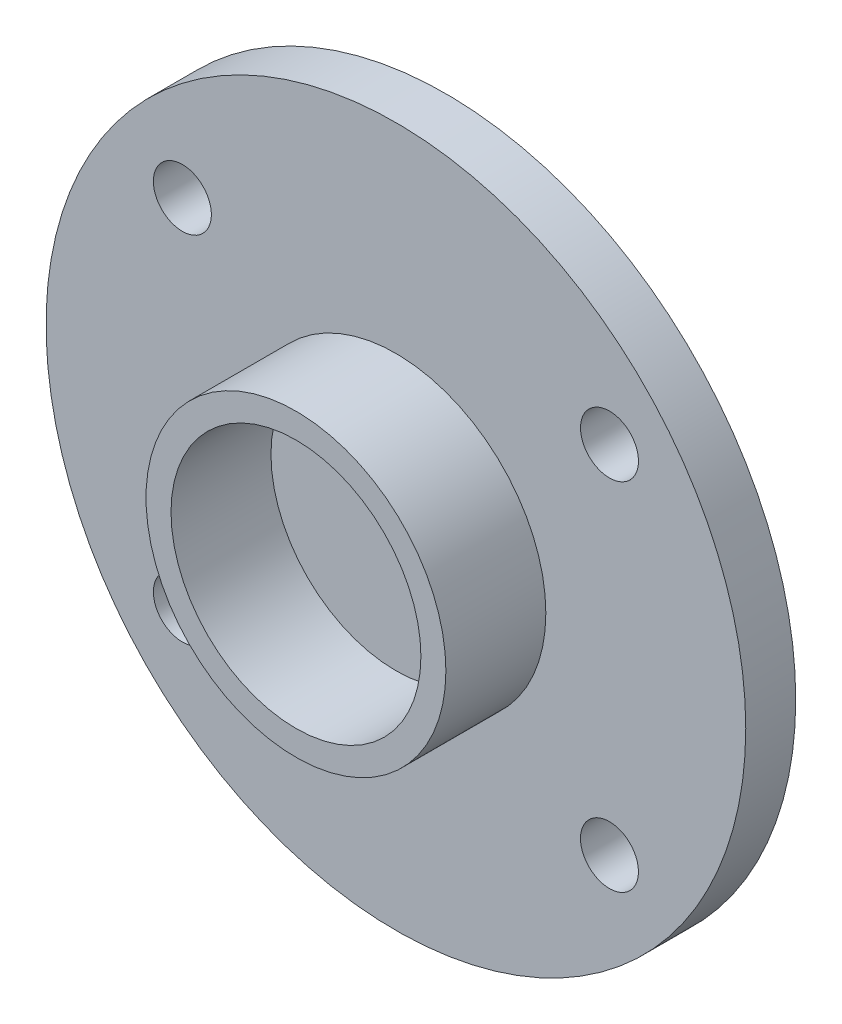
ISO-10303-21;
HEADER;
FILE_DESCRIPTION(('STEP AP214'),'2;1');
FILE_NAME('part.step','',(''),(''),'','','');
FILE_SCHEMA(('AUTOMOTIVE_DESIGN { 1 0 10303 214 1 1 1 1 }'));
ENDSEC;
DATA;
#1=APPLICATION_CONTEXT('core data for automotive mechanical design processes');
#2=APPLICATION_PROTOCOL_DEFINITION('international standard','automotive_design',2000,#1);
#3=PRODUCT_CONTEXT('',#1,'mechanical');
#4=PRODUCT('Part','Part','',(#3));
#5=PRODUCT_RELATED_PRODUCT_CATEGORY('part','',(#4));
#6=PRODUCT_DEFINITION_FORMATION('','',#4);
#7=PRODUCT_DEFINITION_CONTEXT('part definition',#1,'design');
#8=PRODUCT_DEFINITION('design','',#6,#7);
#9=PRODUCT_DEFINITION_SHAPE('','',#8);
#10=(LENGTH_UNIT() NAMED_UNIT(*) SI_UNIT(.MILLI.,.METRE.));
#11=(NAMED_UNIT(*) PLANE_ANGLE_UNIT() SI_UNIT($,.RADIAN.));
#12=(NAMED_UNIT(*) SI_UNIT($,.STERADIAN.) SOLID_ANGLE_UNIT());
#13=UNCERTAINTY_MEASURE_WITH_UNIT(LENGTH_MEASURE(1.E-05),#10,'distance_accuracy_value','');
#14=(GEOMETRIC_REPRESENTATION_CONTEXT(3) GLOBAL_UNCERTAINTY_ASSIGNED_CONTEXT((#13)) GLOBAL_UNIT_ASSIGNED_CONTEXT((#10,
#11,#12)) REPRESENTATION_CONTEXT('',''));
#15=CARTESIAN_POINT('',(0.,0.,0.));
#16=DIRECTION('',(0.,0.,1.));
#17=DIRECTION('',(1.,0.,0.));
#18=AXIS2_PLACEMENT_3D('',#15,#16,#17);
#19=CARTESIAN_POINT('',(0.,0.,1.));
#20=DIRECTION('',(0.,0.,1.));
#21=DIRECTION('',(1.,0.,0.));
#22=AXIS2_PLACEMENT_3D('',#19,#20,#21);
#23=PLANE('',#22);
#24=CARTESIAN_POINT('',(0.,0.,1.));
#25=DIRECTION('',(0.,0.,1.));
#26=DIRECTION('',(1.,0.,0.));
#27=AXIS2_PLACEMENT_3D('',#24,#25,#26);
#28=CIRCLE('',#27,3.);
#29=CARTESIAN_POINT('',(3.,0.,1.));
#30=VERTEX_POINT('',#29);
#31=EDGE_CURVE('E82',#30,#30,#28,.T.);
#32=ORIENTED_EDGE('',*,*,#31,.F.);
#33=EDGE_LOOP('',(#32));
#34=FACE_BOUND('',#33,.T.);
#35=CARTESIAN_POINT('',(4.27289845973805,-3.55751862296857,1.));
#36=DIRECTION('',(0.,0.,1.));
#37=DIRECTION('',(-1.,0.,0.));
#38=AXIS2_PLACEMENT_3D('',#35,#36,#37);
#39=CIRCLE('',#38,0.580000000000001);
#40=CARTESIAN_POINT('',(3.69289845973805,-3.55751862296857,1.));
#41=VERTEX_POINT('',#40);
#42=EDGE_CURVE('E67',#41,#41,#39,.T.);
#43=ORIENTED_EDGE('',*,*,#42,.F.);
#44=EDGE_LOOP('',(#43));
#45=FACE_BOUND('',#44,.T.);
#46=CARTESIAN_POINT('',(4.27289845973805,3.55751862296857,1.));
#47=DIRECTION('',(0.,0.,1.));
#48=DIRECTION('',(1.,0.,0.));
#49=AXIS2_PLACEMENT_3D('',#46,#47,#48);
#50=CIRCLE('',#49,0.580000000000001);
#51=CARTESIAN_POINT('',(4.85289845973805,3.55751862296857,1.));
#52=VERTEX_POINT('',#51);
#53=EDGE_CURVE('E56',#52,#52,#50,.T.);
#54=ORIENTED_EDGE('',*,*,#53,.F.);
#55=EDGE_LOOP('',(#54));
#56=FACE_BOUND('',#55,.T.);
#57=CARTESIAN_POINT('',(0.,0.,1.));
#58=DIRECTION('',(0.,0.,1.));
#59=DIRECTION('',(1.,0.,0.));
#60=AXIS2_PLACEMENT_3D('',#57,#58,#59);
#61=CIRCLE('',#60,7.);
#62=CARTESIAN_POINT('',(7.,0.,1.));
#63=VERTEX_POINT('',#62);
#64=EDGE_CURVE('E47',#63,#63,#61,.T.);
#65=ORIENTED_EDGE('',*,*,#64,.T.);
#66=EDGE_LOOP('',(#65));
#67=FACE_BOUND('',#66,.T.);
#68=CARTESIAN_POINT('',(-4.27289845973805,3.55751862296857,1.));
#69=DIRECTION('',(0.,0.,1.));
#70=DIRECTION('',(-1.,0.,0.));
#71=AXIS2_PLACEMENT_3D('',#68,#69,#70);
#72=CIRCLE('',#71,0.58);
#73=CARTESIAN_POINT('',(-4.85289845973805,3.55751862296857,1.));
#74=VERTEX_POINT('',#73);
#75=EDGE_CURVE('E61',#74,#74,#72,.T.);
#76=ORIENTED_EDGE('',*,*,#75,.F.);
#77=EDGE_LOOP('',(#76));
#78=FACE_BOUND('',#77,.T.);
#79=CARTESIAN_POINT('',(-4.27289845973805,-3.55751862296857,1.));
#80=DIRECTION('',(0.,0.,1.));
#81=DIRECTION('',(1.,0.,0.));
#82=AXIS2_PLACEMENT_3D('',#79,#80,#81);
#83=CIRCLE('',#82,0.58);
#84=CARTESIAN_POINT('',(-3.69289845973805,-3.55751862296857,1.));
#85=VERTEX_POINT('',#84);
#86=EDGE_CURVE('E73',#85,#85,#83,.T.);
#87=ORIENTED_EDGE('',*,*,#86,.F.);
#88=EDGE_LOOP('',(#87));
#89=FACE_BOUND('',#88,.T.);
#90=ADVANCED_FACE('F40',(#34,#45,#56,#67,#78,#89),#23,.T.);
#91=CARTESIAN_POINT('',(0.,0.,0.));
#92=DIRECTION('',(0.,0.,1.));
#93=DIRECTION('',(1.,0.,0.));
#94=AXIS2_PLACEMENT_3D('',#91,#92,#93);
#95=PLANE('',#94);
#96=CARTESIAN_POINT('',(0.,0.,0.));
#97=DIRECTION('',(0.,0.,1.));
#98=DIRECTION('',(1.,0.,0.));
#99=AXIS2_PLACEMENT_3D('',#96,#97,#98);
#100=CIRCLE('',#99,7.);
#101=CARTESIAN_POINT('',(7.,0.,0.));
#102=VERTEX_POINT('',#101);
#103=EDGE_CURVE('E51',#102,#102,#100,.T.);
#104=ORIENTED_EDGE('',*,*,#103,.F.);
#105=EDGE_LOOP('',(#104));
#106=FACE_BOUND('',#105,.T.);
#107=CARTESIAN_POINT('',(4.27289845973805,3.55751862296857,0.));
#108=DIRECTION('',(0.,0.,1.));
#109=DIRECTION('',(1.,0.,0.));
#110=AXIS2_PLACEMENT_3D('',#107,#108,#109);
#111=CIRCLE('',#110,0.580000000000001);
#112=CARTESIAN_POINT('',(4.85289845973805,3.55751862296857,0.));
#113=VERTEX_POINT('',#112);
#114=EDGE_CURVE('E58',#113,#113,#111,.T.);
#115=ORIENTED_EDGE('',*,*,#114,.T.);
#116=EDGE_LOOP('',(#115));
#117=FACE_BOUND('',#116,.T.);
#118=CARTESIAN_POINT('',(-4.27289845973805,3.55751862296857,0.));
#119=DIRECTION('',(0.,0.,1.));
#120=DIRECTION('',(-1.,0.,0.));
#121=AXIS2_PLACEMENT_3D('',#118,#119,#120);
#122=CIRCLE('',#121,0.58);
#123=CARTESIAN_POINT('',(-4.85289845973805,3.55751862296857,0.));
#124=VERTEX_POINT('',#123);
#125=EDGE_CURVE('E64',#124,#124,#122,.T.);
#126=ORIENTED_EDGE('',*,*,#125,.T.);
#127=EDGE_LOOP('',(#126));
#128=FACE_BOUND('',#127,.T.);
#129=CARTESIAN_POINT('',(4.27289845973805,-3.55751862296857,0.));
#130=DIRECTION('',(0.,0.,1.));
#131=DIRECTION('',(-1.,0.,0.));
#132=AXIS2_PLACEMENT_3D('',#129,#130,#131);
#133=CIRCLE('',#132,0.580000000000001);
#134=CARTESIAN_POINT('',(3.69289845973805,-3.55751862296857,0.));
#135=VERTEX_POINT('',#134);
#136=EDGE_CURVE('E70',#135,#135,#133,.T.);
#137=ORIENTED_EDGE('',*,*,#136,.T.);
#138=EDGE_LOOP('',(#137));
#139=FACE_BOUND('',#138,.T.);
#140=CARTESIAN_POINT('',(-4.27289845973805,-3.55751862296857,0.));
#141=DIRECTION('',(0.,0.,1.));
#142=DIRECTION('',(1.,0.,0.));
#143=AXIS2_PLACEMENT_3D('',#140,#141,#142);
#144=CIRCLE('',#143,0.58);
#145=CARTESIAN_POINT('',(-3.69289845973805,-3.55751862296857,0.));
#146=VERTEX_POINT('',#145);
#147=EDGE_CURVE('E76',#146,#146,#144,.T.);
#148=ORIENTED_EDGE('',*,*,#147,.T.);
#149=EDGE_LOOP('',(#148));
#150=FACE_BOUND('',#149,.T.);
#151=ADVANCED_FACE('F110',(#106,#117,#128,#139,#150),#95,.F.);
#152=CARTESIAN_POINT('',(0.,0.,1.));
#153=DIRECTION('',(0.,0.,-1.));
#154=DIRECTION('',(-1.,0.,0.));
#155=AXIS2_PLACEMENT_3D('',#152,#153,#154);
#156=CYLINDRICAL_SURFACE('',#155,7.);
#157=ORIENTED_EDGE('',*,*,#64,.F.);
#158=EDGE_LOOP('',(#157));
#159=FACE_BOUND('',#158,.T.);
#160=ORIENTED_EDGE('',*,*,#103,.T.);
#161=EDGE_LOOP('',(#160));
#162=FACE_BOUND('',#161,.T.);
#163=ADVANCED_FACE('F42',(#159,#162),#156,.T.);
#164=CARTESIAN_POINT('',(4.27289845973805,3.55751862296857,1.));
#165=DIRECTION('',(0.,0.,-1.));
#166=DIRECTION('',(-1.,0.,0.));
#167=AXIS2_PLACEMENT_3D('',#164,#165,#166);
#168=CYLINDRICAL_SURFACE('',#167,0.580000000000001);
#169=ORIENTED_EDGE('',*,*,#53,.T.);
#170=EDGE_LOOP('',(#169));
#171=FACE_BOUND('',#170,.T.);
#172=ORIENTED_EDGE('',*,*,#114,.F.);
#173=EDGE_LOOP('',(#172));
#174=FACE_BOUND('',#173,.T.);
#175=ADVANCED_FACE('F167',(#171,#174),#168,.F.);
#176=CARTESIAN_POINT('',(-4.27289845973805,3.55751862296857,1.));
#177=DIRECTION('',(0.,0.,-1.));
#178=DIRECTION('',(-1.,0.,0.));
#179=AXIS2_PLACEMENT_3D('',#176,#177,#178);
#180=CYLINDRICAL_SURFACE('',#179,0.58);
#181=ORIENTED_EDGE('',*,*,#75,.T.);
#182=EDGE_LOOP('',(#181));
#183=FACE_BOUND('',#182,.T.);
#184=ORIENTED_EDGE('',*,*,#125,.F.);
#185=EDGE_LOOP('',(#184));
#186=FACE_BOUND('',#185,.T.);
#187=ADVANCED_FACE('F157',(#183,#186),#180,.F.);
#188=CARTESIAN_POINT('',(4.27289845973805,-3.55751862296857,1.));
#189=DIRECTION('',(0.,0.,-1.));
#190=DIRECTION('',(-1.,0.,0.));
#191=AXIS2_PLACEMENT_3D('',#188,#189,#190);
#192=CYLINDRICAL_SURFACE('',#191,0.580000000000001);
#193=ORIENTED_EDGE('',*,*,#42,.T.);
#194=EDGE_LOOP('',(#193));
#195=FACE_BOUND('',#194,.T.);
#196=ORIENTED_EDGE('',*,*,#136,.F.);
#197=EDGE_LOOP('',(#196));
#198=FACE_BOUND('',#197,.T.);
#199=ADVANCED_FACE('F105',(#195,#198),#192,.F.);
#200=CARTESIAN_POINT('',(-4.27289845973805,-3.55751862296857,1.));
#201=DIRECTION('',(0.,0.,-1.));
#202=DIRECTION('',(-1.,0.,0.));
#203=AXIS2_PLACEMENT_3D('',#200,#201,#202);
#204=CYLINDRICAL_SURFACE('',#203,0.58);
#205=ORIENTED_EDGE('',*,*,#86,.T.);
#206=EDGE_LOOP('',(#205));
#207=FACE_BOUND('',#206,.T.);
#208=ORIENTED_EDGE('',*,*,#147,.F.);
#209=EDGE_LOOP('',(#208));
#210=FACE_BOUND('',#209,.T.);
#211=ADVANCED_FACE('F96',(#207,#210),#204,.F.);
#212=CARTESIAN_POINT('',(0.,0.,3.));
#213=DIRECTION('',(0.,0.,1.));
#214=DIRECTION('',(1.,0.,0.));
#215=AXIS2_PLACEMENT_3D('',#212,#213,#214);
#216=PLANE('',#215);
#217=CARTESIAN_POINT('',(0.,0.,3.));
#218=DIRECTION('',(0.,0.,1.));
#219=DIRECTION('',(1.,0.,0.));
#220=AXIS2_PLACEMENT_3D('',#217,#218,#219);
#221=CIRCLE('',#220,3.);
#222=CARTESIAN_POINT('',(3.,0.,3.));
#223=VERTEX_POINT('',#222);
#224=EDGE_CURVE('E79',#223,#223,#221,.T.);
#225=ORIENTED_EDGE('',*,*,#224,.T.);
#226=EDGE_LOOP('',(#225));
#227=FACE_BOUND('',#226,.T.);
#228=CARTESIAN_POINT('',(0.,0.,3.));
#229=DIRECTION('',(0.,0.,1.));
#230=DIRECTION('',(1.,0.,0.));
#231=AXIS2_PLACEMENT_3D('',#228,#229,#230);
#232=CIRCLE('',#231,2.5);
#233=CARTESIAN_POINT('',(2.5,0.,3.));
#234=VERTEX_POINT('',#233);
#235=EDGE_CURVE('E85',#234,#234,#232,.T.);
#236=ORIENTED_EDGE('',*,*,#235,.F.);
#237=EDGE_LOOP('',(#236));
#238=FACE_BOUND('',#237,.T.);
#239=ADVANCED_FACE('F93',(#227,#238),#216,.T.);
#240=CARTESIAN_POINT('',(0.,0.,3.));
#241=DIRECTION('',(0.,0.,-1.));
#242=DIRECTION('',(-1.,0.,0.));
#243=AXIS2_PLACEMENT_3D('',#240,#241,#242);
#244=CYLINDRICAL_SURFACE('',#243,3.);
#245=ORIENTED_EDGE('',*,*,#224,.F.);
#246=EDGE_LOOP('',(#245));
#247=FACE_BOUND('',#246,.T.);
#248=ORIENTED_EDGE('',*,*,#31,.T.);
#249=EDGE_LOOP('',(#248));
#250=FACE_BOUND('',#249,.T.);
#251=ADVANCED_FACE('F95',(#247,#250),#244,.T.);
#252=CARTESIAN_POINT('',(0.,0.,3.));
#253=DIRECTION('',(0.,0.,-1.));
#254=DIRECTION('',(-1.,0.,0.));
#255=AXIS2_PLACEMENT_3D('',#252,#253,#254);
#256=CYLINDRICAL_SURFACE('',#255,2.5);
#257=ORIENTED_EDGE('',*,*,#235,.T.);
#258=EDGE_LOOP('',(#257));
#259=FACE_BOUND('',#258,.T.);
#260=CARTESIAN_POINT('',(0.,0.,1.));
#261=DIRECTION('',(0.,0.,1.));
#262=DIRECTION('',(1.,0.,0.));
#263=AXIS2_PLACEMENT_3D('',#260,#261,#262);
#264=CIRCLE('',#263,2.5);
#265=CARTESIAN_POINT('',(2.5,0.,1.));
#266=VERTEX_POINT('',#265);
#267=EDGE_CURVE('E11',#266,#266,#264,.F.);
#268=ORIENTED_EDGE('',*,*,#267,.T.);
#269=EDGE_LOOP('',(#268));
#270=FACE_BOUND('',#269,.T.);
#271=ADVANCED_FACE('F91',(#259,#270),#256,.F.);
#272=ORIENTED_EDGE('',*,*,#267,.F.);
#273=EDGE_LOOP('',(#272));
#274=FACE_BOUND('',#273,.T.);
#275=ADVANCED_FACE('F113',(#274),#23,.T.);
#276=CLOSED_SHELL('',(#90,#151,#163,#175,#187,#199,#211,#239,#251,#271,#275));
#277=MANIFOLD_SOLID_BREP('B2',#276);
#278=ADVANCED_BREP_SHAPE_REPRESENTATION('',(#18,#277),#14);
#279=SHAPE_DEFINITION_REPRESENTATION(#9,#278);
ENDSEC;
END-ISO-10303-21;
